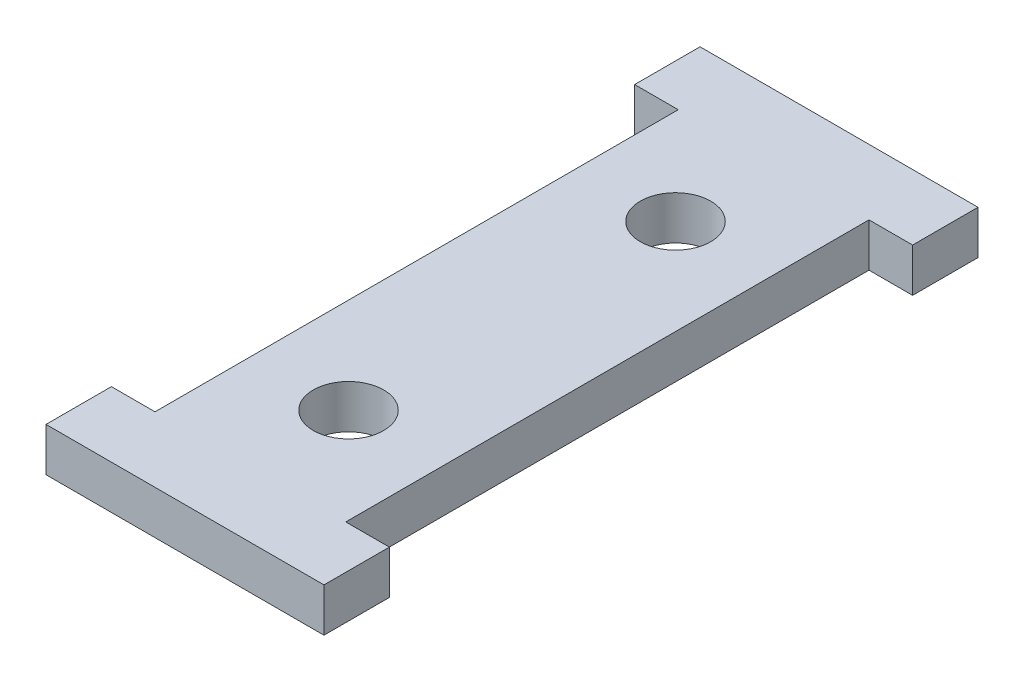
ISO-10303-21;
HEADER;
FILE_DESCRIPTION(('STEP AP214'),'2;1');
FILE_NAME('part.step','',(''),(''),'','','');
FILE_SCHEMA(('AUTOMOTIVE_DESIGN { 1 0 10303 214 1 1 1 1 }'));
ENDSEC;
DATA;
#1=APPLICATION_CONTEXT('core data for automotive mechanical design processes');
#2=APPLICATION_PROTOCOL_DEFINITION('international standard','automotive_design',2000,#1);
#3=PRODUCT_CONTEXT('',#1,'mechanical');
#4=PRODUCT('Part','Part','',(#3));
#5=PRODUCT_RELATED_PRODUCT_CATEGORY('part','',(#4));
#6=PRODUCT_DEFINITION_FORMATION('','',#4);
#7=PRODUCT_DEFINITION_CONTEXT('part definition',#1,'design');
#8=PRODUCT_DEFINITION('design','',#6,#7);
#9=PRODUCT_DEFINITION_SHAPE('','',#8);
#10=(LENGTH_UNIT() NAMED_UNIT(*) SI_UNIT(.MILLI.,.METRE.));
#11=(NAMED_UNIT(*) PLANE_ANGLE_UNIT() SI_UNIT($,.RADIAN.));
#12=(NAMED_UNIT(*) SI_UNIT($,.STERADIAN.) SOLID_ANGLE_UNIT());
#13=UNCERTAINTY_MEASURE_WITH_UNIT(LENGTH_MEASURE(1.E-05),#10,'distance_accuracy_value','');
#14=(GEOMETRIC_REPRESENTATION_CONTEXT(3) GLOBAL_UNCERTAINTY_ASSIGNED_CONTEXT((#13)) GLOBAL_UNIT_ASSIGNED_CONTEXT((#10,
#11,#12)) REPRESENTATION_CONTEXT('',''));
#15=CARTESIAN_POINT('',(0.,0.,0.));
#16=DIRECTION('',(0.,0.,1.));
#17=DIRECTION('',(1.,0.,0.));
#18=AXIS2_PLACEMENT_3D('',#15,#16,#17);
#19=CARTESIAN_POINT('',(16.1925,5.08,-7.62));
#20=DIRECTION('',(-1.,0.,0.));
#21=DIRECTION('',(0.,0.,1.));
#22=AXIS2_PLACEMENT_3D('',#19,#20,#21);
#23=PLANE('',#22);
#24=DIRECTION('',(0.,0.,-1.));
#25=VECTOR('',#24,1.);
#26=CARTESIAN_POINT('',(16.1925,0.,-7.62));
#27=LINE('',#26,#25);
#28=CARTESIAN_POINT('',(16.1925,0.,0.));
#29=VERTEX_POINT('',#28);
#30=CARTESIAN_POINT('',(16.1925,0.,-7.62));
#31=VERTEX_POINT('',#30);
#32=EDGE_CURVE('E170',#29,#31,#27,.T.);
#33=ORIENTED_EDGE('',*,*,#32,.T.);
#34=DIRECTION('',(0.,-1.,0.));
#35=VECTOR('',#34,1.);
#36=CARTESIAN_POINT('',(16.1925,5.08,-7.62));
#37=LINE('',#36,#35);
#38=CARTESIAN_POINT('',(16.1925,5.08,-7.62));
#39=VERTEX_POINT('',#38);
#40=EDGE_CURVE('E11',#39,#31,#37,.T.);
#41=ORIENTED_EDGE('',*,*,#40,.F.);
#42=DIRECTION('',(0.,0.,-1.));
#43=VECTOR('',#42,1.);
#44=CARTESIAN_POINT('',(16.1925,5.08,-7.62));
#45=LINE('',#44,#43);
#46=CARTESIAN_POINT('',(16.1925,5.08,0.));
#47=VERTEX_POINT('',#46);
#48=EDGE_CURVE('E205',#47,#39,#45,.T.);
#49=ORIENTED_EDGE('',*,*,#48,.F.);
#50=DIRECTION('',(0.,-1.,0.));
#51=VECTOR('',#50,1.);
#52=CARTESIAN_POINT('',(16.1925,5.08,0.));
#53=LINE('',#52,#51);
#54=EDGE_CURVE('E166',#47,#29,#53,.T.);
#55=ORIENTED_EDGE('',*,*,#54,.T.);
#56=EDGE_LOOP('',(#33,#41,#49,#55));
#57=FACE_BOUND('',#56,.T.);
#58=ADVANCED_FACE('F45',(#57),#23,.F.);
#59=CARTESIAN_POINT('',(11.1125,5.08,-7.62));
#60=DIRECTION('',(0.,0.,1.));
#61=DIRECTION('',(1.,0.,0.));
#62=AXIS2_PLACEMENT_3D('',#59,#60,#61);
#63=PLANE('',#62);
#64=DIRECTION('',(-1.,0.,0.));
#65=VECTOR('',#64,1.);
#66=CARTESIAN_POINT('',(11.1125,0.,-7.62));
#67=LINE('',#66,#65);
#68=CARTESIAN_POINT('',(11.1125,0.,-7.62));
#69=VERTEX_POINT('',#68);
#70=EDGE_CURVE('E174',#31,#69,#67,.T.);
#71=ORIENTED_EDGE('',*,*,#70,.T.);
#72=DIRECTION('',(0.,-1.,0.));
#73=VECTOR('',#72,1.);
#74=CARTESIAN_POINT('',(11.1125,5.08,-7.62));
#75=LINE('',#74,#73);
#76=CARTESIAN_POINT('',(11.1125,5.08,-7.62));
#77=VERTEX_POINT('',#76);
#78=EDGE_CURVE('E54',#77,#69,#75,.T.);
#79=ORIENTED_EDGE('',*,*,#78,.F.);
#80=DIRECTION('',(-1.,0.,0.));
#81=VECTOR('',#80,1.);
#82=CARTESIAN_POINT('',(11.1125,5.08,-7.62));
#83=LINE('',#82,#81);
#84=EDGE_CURVE('E117',#39,#77,#83,.T.);
#85=ORIENTED_EDGE('',*,*,#84,.F.);
#86=ORIENTED_EDGE('',*,*,#40,.T.);
#87=EDGE_LOOP('',(#71,#79,#85,#86));
#88=FACE_BOUND('',#87,.T.);
#89=ADVANCED_FACE('F300',(#88),#63,.F.);
#90=CARTESIAN_POINT('',(11.1125,5.08,-68.58));
#91=DIRECTION('',(-1.,0.,0.));
#92=DIRECTION('',(0.,0.,1.));
#93=AXIS2_PLACEMENT_3D('',#90,#91,#92);
#94=PLANE('',#93);
#95=DIRECTION('',(0.,0.,-1.));
#96=VECTOR('',#95,1.);
#97=CARTESIAN_POINT('',(11.1125,0.,-68.58));
#98=LINE('',#97,#96);
#99=CARTESIAN_POINT('',(11.1125,0.,-68.58));
#100=VERTEX_POINT('',#99);
#101=EDGE_CURVE('E178',#69,#100,#98,.T.);
#102=ORIENTED_EDGE('',*,*,#101,.T.);
#103=DIRECTION('',(0.,-1.,0.));
#104=VECTOR('',#103,1.);
#105=CARTESIAN_POINT('',(11.1125,5.08,-68.58));
#106=LINE('',#105,#104);
#107=CARTESIAN_POINT('',(11.1125,5.08,-68.58));
#108=VERTEX_POINT('',#107);
#109=EDGE_CURVE('E232',#108,#100,#106,.T.);
#110=ORIENTED_EDGE('',*,*,#109,.F.);
#111=DIRECTION('',(0.,0.,-1.));
#112=VECTOR('',#111,1.);
#113=CARTESIAN_POINT('',(11.1125,5.08,-68.58));
#114=LINE('',#113,#112);
#115=EDGE_CURVE('E242',#77,#108,#114,.T.);
#116=ORIENTED_EDGE('',*,*,#115,.F.);
#117=ORIENTED_EDGE('',*,*,#78,.T.);
#118=EDGE_LOOP('',(#102,#110,#116,#117));
#119=FACE_BOUND('',#118,.T.);
#120=ADVANCED_FACE('F240',(#119),#94,.F.);
#121=CARTESIAN_POINT('',(16.1925,5.08,-68.58));
#122=DIRECTION('',(0.,0.,-1.));
#123=DIRECTION('',(-1.,0.,0.));
#124=AXIS2_PLACEMENT_3D('',#121,#122,#123);
#125=PLANE('',#124);
#126=DIRECTION('',(1.,0.,0.));
#127=VECTOR('',#126,1.);
#128=CARTESIAN_POINT('',(16.1925,0.,-68.58));
#129=LINE('',#128,#127);
#130=CARTESIAN_POINT('',(16.1925,0.,-68.58));
#131=VERTEX_POINT('',#130);
#132=EDGE_CURVE('E181',#100,#131,#129,.T.);
#133=ORIENTED_EDGE('',*,*,#132,.T.);
#134=DIRECTION('',(0.,-1.,0.));
#135=VECTOR('',#134,1.);
#136=CARTESIAN_POINT('',(16.1925,5.08,-68.58));
#137=LINE('',#136,#135);
#138=CARTESIAN_POINT('',(16.1925,5.08,-68.58));
#139=VERTEX_POINT('',#138);
#140=EDGE_CURVE('E228',#139,#131,#137,.T.);
#141=ORIENTED_EDGE('',*,*,#140,.F.);
#142=DIRECTION('',(1.,0.,0.));
#143=VECTOR('',#142,1.);
#144=CARTESIAN_POINT('',(16.1925,5.08,-68.58));
#145=LINE('',#144,#143);
#146=EDGE_CURVE('E261',#108,#139,#145,.T.);
#147=ORIENTED_EDGE('',*,*,#146,.F.);
#148=ORIENTED_EDGE('',*,*,#109,.T.);
#149=EDGE_LOOP('',(#133,#141,#147,#148));
#150=FACE_BOUND('',#149,.T.);
#151=ADVANCED_FACE('F251',(#150),#125,.F.);
#152=CARTESIAN_POINT('',(16.1925,5.08,-76.2));
#153=DIRECTION('',(-1.,0.,0.));
#154=DIRECTION('',(0.,0.,1.));
#155=AXIS2_PLACEMENT_3D('',#152,#153,#154);
#156=PLANE('',#155);
#157=DIRECTION('',(0.,0.,-1.));
#158=VECTOR('',#157,1.);
#159=CARTESIAN_POINT('',(16.1925,0.,-76.2));
#160=LINE('',#159,#158);
#161=CARTESIAN_POINT('',(16.1925,0.,-76.2));
#162=VERTEX_POINT('',#161);
#163=EDGE_CURVE('E184',#131,#162,#160,.T.);
#164=ORIENTED_EDGE('',*,*,#163,.T.);
#165=DIRECTION('',(0.,-1.,0.));
#166=VECTOR('',#165,1.);
#167=CARTESIAN_POINT('',(16.1925,5.08,-76.2));
#168=LINE('',#167,#166);
#169=CARTESIAN_POINT('',(16.1925,5.08,-76.2));
#170=VERTEX_POINT('',#169);
#171=EDGE_CURVE('E224',#170,#162,#168,.T.);
#172=ORIENTED_EDGE('',*,*,#171,.F.);
#173=DIRECTION('',(0.,0.,-1.));
#174=VECTOR('',#173,1.);
#175=CARTESIAN_POINT('',(16.1925,5.08,-76.2));
#176=LINE('',#175,#174);
#177=EDGE_CURVE('E257',#139,#170,#176,.T.);
#178=ORIENTED_EDGE('',*,*,#177,.F.);
#179=ORIENTED_EDGE('',*,*,#140,.T.);
#180=EDGE_LOOP('',(#164,#172,#178,#179));
#181=FACE_BOUND('',#180,.T.);
#182=ADVANCED_FACE('F255',(#181),#156,.F.);
#183=CARTESIAN_POINT('',(-16.1925,5.08,-76.2));
#184=DIRECTION('',(0.,0.,1.));
#185=DIRECTION('',(1.,0.,0.));
#186=AXIS2_PLACEMENT_3D('',#183,#184,#185);
#187=PLANE('',#186);
#188=DIRECTION('',(-1.,0.,0.));
#189=VECTOR('',#188,1.);
#190=CARTESIAN_POINT('',(-16.1925,0.,-76.2));
#191=LINE('',#190,#189);
#192=CARTESIAN_POINT('',(-16.1925,0.,-76.2));
#193=VERTEX_POINT('',#192);
#194=EDGE_CURVE('E187',#162,#193,#191,.T.);
#195=ORIENTED_EDGE('',*,*,#194,.T.);
#196=DIRECTION('',(0.,-1.,0.));
#197=VECTOR('',#196,1.);
#198=CARTESIAN_POINT('',(-16.1925,5.08,-76.2));
#199=LINE('',#198,#197);
#200=CARTESIAN_POINT('',(-16.1925,5.08,-76.2));
#201=VERTEX_POINT('',#200);
#202=EDGE_CURVE('E220',#201,#193,#199,.T.);
#203=ORIENTED_EDGE('',*,*,#202,.F.);
#204=DIRECTION('',(-1.,0.,0.));
#205=VECTOR('',#204,1.);
#206=CARTESIAN_POINT('',(-16.1925,5.08,-76.2));
#207=LINE('',#206,#205);
#208=EDGE_CURVE('E260',#170,#201,#207,.T.);
#209=ORIENTED_EDGE('',*,*,#208,.F.);
#210=ORIENTED_EDGE('',*,*,#171,.T.);
#211=EDGE_LOOP('',(#195,#203,#209,#210));
#212=FACE_BOUND('',#211,.T.);
#213=ADVANCED_FACE('F313',(#212),#187,.F.);
#214=CARTESIAN_POINT('',(-16.1925,5.08,-68.58));
#215=DIRECTION('',(1.,0.,0.));
#216=DIRECTION('',(0.,0.,-1.));
#217=AXIS2_PLACEMENT_3D('',#214,#215,#216);
#218=PLANE('',#217);
#219=DIRECTION('',(0.,0.,1.));
#220=VECTOR('',#219,1.);
#221=CARTESIAN_POINT('',(-16.1925,0.,-68.58));
#222=LINE('',#221,#220);
#223=CARTESIAN_POINT('',(-16.1925,0.,-68.58));
#224=VERTEX_POINT('',#223);
#225=EDGE_CURVE('E190',#193,#224,#222,.T.);
#226=ORIENTED_EDGE('',*,*,#225,.T.);
#227=DIRECTION('',(0.,-1.,0.));
#228=VECTOR('',#227,1.);
#229=CARTESIAN_POINT('',(-16.1925,5.08,-68.58));
#230=LINE('',#229,#228);
#231=CARTESIAN_POINT('',(-16.1925,5.08,-68.58));
#232=VERTEX_POINT('',#231);
#233=EDGE_CURVE('E216',#232,#224,#230,.T.);
#234=ORIENTED_EDGE('',*,*,#233,.F.);
#235=DIRECTION('',(0.,0.,1.));
#236=VECTOR('',#235,1.);
#237=CARTESIAN_POINT('',(-16.1925,5.08,-68.58));
#238=LINE('',#237,#236);
#239=EDGE_CURVE('E265',#201,#232,#238,.T.);
#240=ORIENTED_EDGE('',*,*,#239,.F.);
#241=ORIENTED_EDGE('',*,*,#202,.T.);
#242=EDGE_LOOP('',(#226,#234,#240,#241));
#243=FACE_BOUND('',#242,.T.);
#244=ADVANCED_FACE('F316',(#243),#218,.F.);
#245=CARTESIAN_POINT('',(-11.1125,5.08,-68.58));
#246=DIRECTION('',(0.,0.,-1.));
#247=DIRECTION('',(-1.,0.,0.));
#248=AXIS2_PLACEMENT_3D('',#245,#246,#247);
#249=PLANE('',#248);
#250=DIRECTION('',(1.,0.,0.));
#251=VECTOR('',#250,1.);
#252=CARTESIAN_POINT('',(-11.1125,0.,-68.58));
#253=LINE('',#252,#251);
#254=CARTESIAN_POINT('',(-11.1125,0.,-68.58));
#255=VERTEX_POINT('',#254);
#256=EDGE_CURVE('E193',#224,#255,#253,.T.);
#257=ORIENTED_EDGE('',*,*,#256,.T.);
#258=DIRECTION('',(0.,-1.,0.));
#259=VECTOR('',#258,1.);
#260=CARTESIAN_POINT('',(-11.1125,5.08,-68.58));
#261=LINE('',#260,#259);
#262=CARTESIAN_POINT('',(-11.1125,5.08,-68.58));
#263=VERTEX_POINT('',#262);
#264=EDGE_CURVE('E212',#263,#255,#261,.T.);
#265=ORIENTED_EDGE('',*,*,#264,.F.);
#266=DIRECTION('',(1.,0.,0.));
#267=VECTOR('',#266,1.);
#268=CARTESIAN_POINT('',(-11.1125,5.08,-68.58));
#269=LINE('',#268,#267);
#270=EDGE_CURVE('E272',#232,#263,#269,.T.);
#271=ORIENTED_EDGE('',*,*,#270,.F.);
#272=ORIENTED_EDGE('',*,*,#233,.T.);
#273=EDGE_LOOP('',(#257,#265,#271,#272));
#274=FACE_BOUND('',#273,.T.);
#275=ADVANCED_FACE('F280',(#274),#249,.F.);
#276=CARTESIAN_POINT('',(-11.1125,5.08,-7.62));
#277=DIRECTION('',(1.,0.,0.));
#278=DIRECTION('',(0.,0.,-1.));
#279=AXIS2_PLACEMENT_3D('',#276,#277,#278);
#280=PLANE('',#279);
#281=DIRECTION('',(0.,0.,1.));
#282=VECTOR('',#281,1.);
#283=CARTESIAN_POINT('',(-11.1125,0.,-7.62));
#284=LINE('',#283,#282);
#285=CARTESIAN_POINT('',(-11.1125,0.,-7.62));
#286=VERTEX_POINT('',#285);
#287=EDGE_CURVE('E196',#255,#286,#284,.T.);
#288=ORIENTED_EDGE('',*,*,#287,.T.);
#289=DIRECTION('',(0.,-1.,0.));
#290=VECTOR('',#289,1.);
#291=CARTESIAN_POINT('',(-11.1125,5.08,-7.62));
#292=LINE('',#291,#290);
#293=CARTESIAN_POINT('',(-11.1125,5.08,-7.62));
#294=VERTEX_POINT('',#293);
#295=EDGE_CURVE('E159',#294,#286,#292,.T.);
#296=ORIENTED_EDGE('',*,*,#295,.F.);
#297=DIRECTION('',(0.,0.,1.));
#298=VECTOR('',#297,1.);
#299=CARTESIAN_POINT('',(-11.1125,5.08,-7.62));
#300=LINE('',#299,#298);
#301=EDGE_CURVE('E148',#263,#294,#300,.T.);
#302=ORIENTED_EDGE('',*,*,#301,.F.);
#303=ORIENTED_EDGE('',*,*,#264,.T.);
#304=EDGE_LOOP('',(#288,#296,#302,#303));
#305=FACE_BOUND('',#304,.T.);
#306=ADVANCED_FACE('F284',(#305),#280,.F.);
#307=CARTESIAN_POINT('',(-16.1925,5.08,-7.62));
#308=DIRECTION('',(0.,0.,1.));
#309=DIRECTION('',(1.,0.,0.));
#310=AXIS2_PLACEMENT_3D('',#307,#308,#309);
#311=PLANE('',#310);
#312=DIRECTION('',(-1.,0.,0.));
#313=VECTOR('',#312,1.);
#314=CARTESIAN_POINT('',(-16.1925,0.,-7.62));
#315=LINE('',#314,#313);
#316=CARTESIAN_POINT('',(-16.1925,0.,-7.62));
#317=VERTEX_POINT('',#316);
#318=EDGE_CURVE('E157',#286,#317,#315,.T.);
#319=ORIENTED_EDGE('',*,*,#318,.T.);
#320=DIRECTION('',(0.,-1.,0.));
#321=VECTOR('',#320,1.);
#322=CARTESIAN_POINT('',(-16.1925,5.08,-7.62));
#323=LINE('',#322,#321);
#324=CARTESIAN_POINT('',(-16.1925,5.08,-7.62));
#325=VERTEX_POINT('',#324);
#326=EDGE_CURVE('E154',#325,#317,#323,.T.);
#327=ORIENTED_EDGE('',*,*,#326,.F.);
#328=DIRECTION('',(-1.,0.,0.));
#329=VECTOR('',#328,1.);
#330=CARTESIAN_POINT('',(-16.1925,5.08,-7.62));
#331=LINE('',#330,#329);
#332=EDGE_CURVE('E142',#294,#325,#331,.T.);
#333=ORIENTED_EDGE('',*,*,#332,.F.);
#334=ORIENTED_EDGE('',*,*,#295,.T.);
#335=EDGE_LOOP('',(#319,#327,#333,#334));
#336=FACE_BOUND('',#335,.T.);
#337=ADVANCED_FACE('F155',(#336),#311,.F.);
#338=CARTESIAN_POINT('',(-16.1925,5.08,0.));
#339=DIRECTION('',(1.,0.,0.));
#340=DIRECTION('',(0.,0.,-1.));
#341=AXIS2_PLACEMENT_3D('',#338,#339,#340);
#342=PLANE('',#341);
#343=DIRECTION('',(0.,0.,1.));
#344=VECTOR('',#343,1.);
#345=CARTESIAN_POINT('',(-16.1925,0.,0.));
#346=LINE('',#345,#344);
#347=CARTESIAN_POINT('',(-16.1925,0.,0.));
#348=VERTEX_POINT('',#347);
#349=EDGE_CURVE('E103',#317,#348,#346,.T.);
#350=ORIENTED_EDGE('',*,*,#349,.T.);
#351=DIRECTION('',(0.,-1.,0.));
#352=VECTOR('',#351,1.);
#353=CARTESIAN_POINT('',(-16.1925,5.08,0.));
#354=LINE('',#353,#352);
#355=CARTESIAN_POINT('',(-16.1925,5.08,0.));
#356=VERTEX_POINT('',#355);
#357=EDGE_CURVE('E160',#356,#348,#354,.T.);
#358=ORIENTED_EDGE('',*,*,#357,.F.);
#359=DIRECTION('',(0.,0.,1.));
#360=VECTOR('',#359,1.);
#361=CARTESIAN_POINT('',(-16.1925,5.08,0.));
#362=LINE('',#361,#360);
#363=EDGE_CURVE('E146',#325,#356,#362,.T.);
#364=ORIENTED_EDGE('',*,*,#363,.F.);
#365=ORIENTED_EDGE('',*,*,#326,.T.);
#366=EDGE_LOOP('',(#350,#358,#364,#365));
#367=FACE_BOUND('',#366,.T.);
#368=ADVANCED_FACE('F162',(#367),#342,.F.);
#369=CARTESIAN_POINT('',(-16.1925,5.08,0.));
#370=DIRECTION('',(0.,0.,-1.));
#371=DIRECTION('',(-1.,0.,0.));
#372=AXIS2_PLACEMENT_3D('',#369,#370,#371);
#373=PLANE('',#372);
#374=DIRECTION('',(1.,0.,0.));
#375=VECTOR('',#374,1.);
#376=CARTESIAN_POINT('',(-16.1925,0.,0.));
#377=LINE('',#376,#375);
#378=EDGE_CURVE('E109',#348,#29,#377,.T.);
#379=ORIENTED_EDGE('',*,*,#378,.T.);
#380=ORIENTED_EDGE('',*,*,#54,.F.);
#381=DIRECTION('',(1.,0.,0.));
#382=VECTOR('',#381,1.);
#383=CARTESIAN_POINT('',(-16.1925,5.08,0.));
#384=LINE('',#383,#382);
#385=EDGE_CURVE('E62',#356,#47,#384,.T.);
#386=ORIENTED_EDGE('',*,*,#385,.F.);
#387=ORIENTED_EDGE('',*,*,#357,.T.);
#388=EDGE_LOOP('',(#379,#380,#386,#387));
#389=FACE_BOUND('',#388,.T.);
#390=ADVANCED_FACE('F288',(#389),#373,.F.);
#391=CARTESIAN_POINT('',(0.,5.08,0.));
#392=DIRECTION('',(0.,1.,0.));
#393=DIRECTION('',(0.,0.,1.));
#394=AXIS2_PLACEMENT_3D('',#391,#392,#393);
#395=PLANE('',#394);
#396=CARTESIAN_POINT('',(0.,5.08,-57.15));
#397=DIRECTION('',(0.,1.,0.));
#398=DIRECTION('',(0.,0.,1.));
#399=AXIS2_PLACEMENT_3D('',#396,#397,#398);
#400=CIRCLE('',#399,4.1021);
#401=CARTESIAN_POINT('',(0.,5.08,-53.0479));
#402=VERTEX_POINT('',#401);
#403=EDGE_CURVE('E465',#402,#402,#400,.T.);
#404=ORIENTED_EDGE('',*,*,#403,.F.);
#405=EDGE_LOOP('',(#404));
#406=FACE_BOUND('',#405,.T.);
#407=CARTESIAN_POINT('',(0.,5.08,-19.05));
#408=DIRECTION('',(0.,1.,0.));
#409=DIRECTION('',(0.,0.,1.));
#410=AXIS2_PLACEMENT_3D('',#407,#408,#409);
#411=CIRCLE('',#410,4.1021);
#412=CARTESIAN_POINT('',(0.,5.08,-14.9479));
#413=VERTEX_POINT('',#412);
#414=EDGE_CURVE('E470',#413,#413,#411,.T.);
#415=ORIENTED_EDGE('',*,*,#414,.F.);
#416=EDGE_LOOP('',(#415));
#417=FACE_BOUND('',#416,.T.);
#418=ORIENTED_EDGE('',*,*,#48,.T.);
#419=ORIENTED_EDGE('',*,*,#84,.T.);
#420=ORIENTED_EDGE('',*,*,#115,.T.);
#421=ORIENTED_EDGE('',*,*,#146,.T.);
#422=ORIENTED_EDGE('',*,*,#177,.T.);
#423=ORIENTED_EDGE('',*,*,#208,.T.);
#424=ORIENTED_EDGE('',*,*,#239,.T.);
#425=ORIENTED_EDGE('',*,*,#270,.T.);
#426=ORIENTED_EDGE('',*,*,#301,.T.);
#427=ORIENTED_EDGE('',*,*,#332,.T.);
#428=ORIENTED_EDGE('',*,*,#363,.T.);
#429=ORIENTED_EDGE('',*,*,#385,.T.);
#430=EDGE_LOOP('',(#418,#419,#420,#421,#422,#423,#424,#425,#426,#427,#428,#429));
#431=FACE_BOUND('',#430,.T.);
#432=ADVANCED_FACE('F144',(#406,#417,#431),#395,.T.);
#433=CARTESIAN_POINT('',(0.,0.,0.));
#434=DIRECTION('',(0.,1.,0.));
#435=DIRECTION('',(0.,0.,1.));
#436=AXIS2_PLACEMENT_3D('',#433,#434,#435);
#437=PLANE('',#436);
#438=CARTESIAN_POINT('',(0.,0.,-57.15));
#439=DIRECTION('',(0.,1.,0.));
#440=DIRECTION('',(0.,0.,1.));
#441=AXIS2_PLACEMENT_3D('',#438,#439,#440);
#442=CIRCLE('',#441,4.1021);
#443=CARTESIAN_POINT('',(0.,0.,-53.0479));
#444=VERTEX_POINT('',#443);
#445=EDGE_CURVE('E468',#444,#444,#442,.T.);
#446=ORIENTED_EDGE('',*,*,#445,.T.);
#447=EDGE_LOOP('',(#446));
#448=FACE_BOUND('',#447,.T.);
#449=CARTESIAN_POINT('',(0.,0.,-19.05));
#450=DIRECTION('',(0.,1.,0.));
#451=DIRECTION('',(0.,0.,1.));
#452=AXIS2_PLACEMENT_3D('',#449,#450,#451);
#453=CIRCLE('',#452,4.1021);
#454=CARTESIAN_POINT('',(0.,0.,-14.9479));
#455=VERTEX_POINT('',#454);
#456=EDGE_CURVE('E175',#455,#455,#453,.T.);
#457=ORIENTED_EDGE('',*,*,#456,.T.);
#458=EDGE_LOOP('',(#457));
#459=FACE_BOUND('',#458,.T.);
#460=ORIENTED_EDGE('',*,*,#32,.F.);
#461=ORIENTED_EDGE('',*,*,#378,.F.);
#462=ORIENTED_EDGE('',*,*,#349,.F.);
#463=ORIENTED_EDGE('',*,*,#318,.F.);
#464=ORIENTED_EDGE('',*,*,#287,.F.);
#465=ORIENTED_EDGE('',*,*,#256,.F.);
#466=ORIENTED_EDGE('',*,*,#225,.F.);
#467=ORIENTED_EDGE('',*,*,#194,.F.);
#468=ORIENTED_EDGE('',*,*,#163,.F.);
#469=ORIENTED_EDGE('',*,*,#132,.F.);
#470=ORIENTED_EDGE('',*,*,#101,.F.);
#471=ORIENTED_EDGE('',*,*,#70,.F.);
#472=EDGE_LOOP('',(#460,#461,#462,#463,#464,#465,#466,#467,#468,#469,#470,#471));
#473=FACE_BOUND('',#472,.T.);
#474=ADVANCED_FACE('F246',(#448,#459,#473),#437,.F.);
#475=CARTESIAN_POINT('',(0.,5.08,-19.05));
#476=DIRECTION('',(0.,1.,0.));
#477=DIRECTION('',(0.,0.,1.));
#478=AXIS2_PLACEMENT_3D('',#475,#476,#477);
#479=CYLINDRICAL_SURFACE('',#478,4.1021);
#480=ORIENTED_EDGE('',*,*,#414,.T.);
#481=EDGE_LOOP('',(#480));
#482=FACE_BOUND('',#481,.T.);
#483=ORIENTED_EDGE('',*,*,#456,.F.);
#484=EDGE_LOOP('',(#483));
#485=FACE_BOUND('',#484,.T.);
#486=ADVANCED_FACE('F356',(#482,#485),#479,.F.);
#487=CARTESIAN_POINT('',(0.,5.08,-57.15));
#488=DIRECTION('',(0.,1.,0.));
#489=DIRECTION('',(0.,0.,1.));
#490=AXIS2_PLACEMENT_3D('',#487,#488,#489);
#491=CYLINDRICAL_SURFACE('',#490,4.1021);
#492=ORIENTED_EDGE('',*,*,#403,.T.);
#493=EDGE_LOOP('',(#492));
#494=FACE_BOUND('',#493,.T.);
#495=ORIENTED_EDGE('',*,*,#445,.F.);
#496=EDGE_LOOP('',(#495));
#497=FACE_BOUND('',#496,.T.);
#498=ADVANCED_FACE('F367',(#494,#497),#491,.F.);
#499=CLOSED_SHELL('',(#58,#89,#120,#151,#182,#213,#244,#275,#306,#337,#368,#390,#432,#474,#486,#498));
#500=MANIFOLD_SOLID_BREP('B2',#499);
#501=ADVANCED_BREP_SHAPE_REPRESENTATION('',(#18,#500),#14);
#502=SHAPE_DEFINITION_REPRESENTATION(#9,#501);
ENDSEC;
END-ISO-10303-21;
